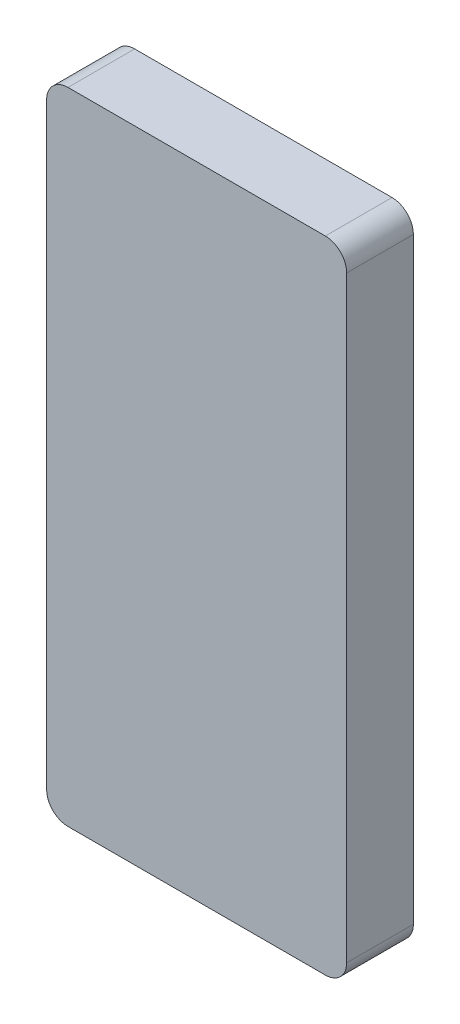
ISO-10303-21;
HEADER;
FILE_DESCRIPTION(('STEP AP214'),'2;1');
FILE_NAME('part.step','',(''),(''),'','','');
FILE_SCHEMA(('AUTOMOTIVE_DESIGN { 1 0 10303 214 1 1 1 1 }'));
ENDSEC;
DATA;
#1=APPLICATION_CONTEXT('core data for automotive mechanical design processes');
#2=APPLICATION_PROTOCOL_DEFINITION('international standard','automotive_design',2000,#1);
#3=PRODUCT_CONTEXT('',#1,'mechanical');
#4=PRODUCT('Part','Part','',(#3));
#5=PRODUCT_RELATED_PRODUCT_CATEGORY('part','',(#4));
#6=PRODUCT_DEFINITION_FORMATION('','',#4);
#7=PRODUCT_DEFINITION_CONTEXT('part definition',#1,'design');
#8=PRODUCT_DEFINITION('design','',#6,#7);
#9=PRODUCT_DEFINITION_SHAPE('','',#8);
#10=(LENGTH_UNIT() NAMED_UNIT(*) SI_UNIT(.MILLI.,.METRE.));
#11=(NAMED_UNIT(*) PLANE_ANGLE_UNIT() SI_UNIT($,.RADIAN.));
#12=(NAMED_UNIT(*) SI_UNIT($,.STERADIAN.) SOLID_ANGLE_UNIT());
#13=UNCERTAINTY_MEASURE_WITH_UNIT(LENGTH_MEASURE(1.E-05),#10,'distance_accuracy_value','');
#14=(GEOMETRIC_REPRESENTATION_CONTEXT(3) GLOBAL_UNCERTAINTY_ASSIGNED_CONTEXT((#13)) GLOBAL_UNIT_ASSIGNED_CONTEXT((#10,
#11,#12)) REPRESENTATION_CONTEXT('',''));
#15=CARTESIAN_POINT('',(0.,0.,0.));
#16=DIRECTION('',(0.,0.,1.));
#17=DIRECTION('',(1.,0.,0.));
#18=AXIS2_PLACEMENT_3D('',#15,#16,#17);
#19=CARTESIAN_POINT('',(-30.63875,71.12,15.875));
#20=DIRECTION('',(0.,0.,-1.));
#21=DIRECTION('',(-1.,0.,0.));
#22=AXIS2_PLACEMENT_3D('',#19,#20,#21);
#23=CYLINDRICAL_SURFACE('',#22,5.08);
#24=CARTESIAN_POINT('',(-30.63875,71.12,0.));
#25=DIRECTION('',(0.,0.,1.));
#26=DIRECTION('',(1.,0.,0.));
#27=AXIS2_PLACEMENT_3D('',#24,#25,#26);
#28=CIRCLE('',#27,5.08);
#29=CARTESIAN_POINT('',(-30.63875,76.2,0.));
#30=VERTEX_POINT('',#29);
#31=CARTESIAN_POINT('',(-35.71875,71.12,0.));
#32=VERTEX_POINT('',#31);
#33=EDGE_CURVE('E148',#30,#32,#28,.T.);
#34=ORIENTED_EDGE('',*,*,#33,.T.);
#35=DIRECTION('',(0.,0.,-1.));
#36=VECTOR('',#35,1.);
#37=CARTESIAN_POINT('',(-35.71875,71.12,15.875));
#38=LINE('',#37,#36);
#39=CARTESIAN_POINT('',(-35.71875,71.12,15.875));
#40=VERTEX_POINT('',#39);
#41=EDGE_CURVE('E13',#40,#32,#38,.T.);
#42=ORIENTED_EDGE('',*,*,#41,.F.);
#43=CARTESIAN_POINT('',(-30.63875,71.12,15.875));
#44=DIRECTION('',(0.,0.,1.));
#45=DIRECTION('',(1.,0.,0.));
#46=AXIS2_PLACEMENT_3D('',#43,#44,#45);
#47=CIRCLE('',#46,5.08);
#48=CARTESIAN_POINT('',(-30.63875,76.2,15.875));
#49=VERTEX_POINT('',#48);
#50=EDGE_CURVE('E170',#49,#40,#47,.T.);
#51=ORIENTED_EDGE('',*,*,#50,.F.);
#52=DIRECTION('',(0.,0.,-1.));
#53=VECTOR('',#52,1.);
#54=CARTESIAN_POINT('',(-30.63875,76.2,15.875));
#55=LINE('',#54,#53);
#56=EDGE_CURVE('E144',#49,#30,#55,.T.);
#57=ORIENTED_EDGE('',*,*,#56,.T.);
#58=EDGE_LOOP('',(#34,#42,#51,#57));
#59=FACE_BOUND('',#58,.T.);
#60=ADVANCED_FACE('F46',(#59),#23,.T.);
#61=CARTESIAN_POINT('',(-35.71875,71.12,15.875));
#62=DIRECTION('',(1.,0.,0.));
#63=DIRECTION('',(0.,1.,0.));
#64=AXIS2_PLACEMENT_3D('',#61,#62,#63);
#65=PLANE('',#64);
#66=DIRECTION('',(0.,-1.,0.));
#67=VECTOR('',#66,1.);
#68=CARTESIAN_POINT('',(-35.71875,71.12,0.));
#69=LINE('',#68,#67);
#70=CARTESIAN_POINT('',(-35.71875,-71.12,0.));
#71=VERTEX_POINT('',#70);
#72=EDGE_CURVE('E152',#32,#71,#69,.T.);
#73=ORIENTED_EDGE('',*,*,#72,.T.);
#74=DIRECTION('',(0.,0.,-1.));
#75=VECTOR('',#74,1.);
#76=CARTESIAN_POINT('',(-35.71875,-71.12,15.875));
#77=LINE('',#76,#75);
#78=CARTESIAN_POINT('',(-35.71875,-71.12,15.875));
#79=VERTEX_POINT('',#78);
#80=EDGE_CURVE('E55',#79,#71,#77,.T.);
#81=ORIENTED_EDGE('',*,*,#80,.F.);
#82=DIRECTION('',(0.,-1.,0.));
#83=VECTOR('',#82,1.);
#84=CARTESIAN_POINT('',(-35.71875,71.12,15.875));
#85=LINE('',#84,#83);
#86=EDGE_CURVE('E106',#40,#79,#85,.T.);
#87=ORIENTED_EDGE('',*,*,#86,.F.);
#88=ORIENTED_EDGE('',*,*,#41,.T.);
#89=EDGE_LOOP('',(#73,#81,#87,#88));
#90=FACE_BOUND('',#89,.T.);
#91=ADVANCED_FACE('F219',(#90),#65,.F.);
#92=CARTESIAN_POINT('',(-30.63875,-71.12,15.875));
#93=DIRECTION('',(0.,0.,-1.));
#94=DIRECTION('',(-1.,0.,0.));
#95=AXIS2_PLACEMENT_3D('',#92,#93,#94);
#96=CYLINDRICAL_SURFACE('',#95,5.08);
#97=CARTESIAN_POINT('',(-30.63875,-71.12,0.));
#98=DIRECTION('',(0.,0.,1.));
#99=DIRECTION('',(1.,0.,0.));
#100=AXIS2_PLACEMENT_3D('',#97,#98,#99);
#101=CIRCLE('',#100,5.08);
#102=CARTESIAN_POINT('',(-30.63875,-76.2,0.));
#103=VERTEX_POINT('',#102);
#104=EDGE_CURVE('E155',#71,#103,#101,.T.);
#105=ORIENTED_EDGE('',*,*,#104,.T.);
#106=DIRECTION('',(0.,0.,-1.));
#107=VECTOR('',#106,1.);
#108=CARTESIAN_POINT('',(-30.63875,-76.2,15.875));
#109=LINE('',#108,#107);
#110=CARTESIAN_POINT('',(-30.63875,-76.2,15.875));
#111=VERTEX_POINT('',#110);
#112=EDGE_CURVE('E181',#111,#103,#109,.T.);
#113=ORIENTED_EDGE('',*,*,#112,.F.);
#114=CARTESIAN_POINT('',(-30.63875,-71.12,15.875));
#115=DIRECTION('',(0.,0.,1.));
#116=DIRECTION('',(1.,0.,0.));
#117=AXIS2_PLACEMENT_3D('',#114,#115,#116);
#118=CIRCLE('',#117,5.08);
#119=EDGE_CURVE('E192',#79,#111,#118,.T.);
#120=ORIENTED_EDGE('',*,*,#119,.F.);
#121=ORIENTED_EDGE('',*,*,#80,.T.);
#122=EDGE_LOOP('',(#105,#113,#120,#121));
#123=FACE_BOUND('',#122,.T.);
#124=ADVANCED_FACE('F190',(#123),#96,.T.);
#125=CARTESIAN_POINT('',(-30.63875,-76.2,15.875));
#126=DIRECTION('',(0.,1.,0.));
#127=DIRECTION('',(0.,0.,1.));
#128=AXIS2_PLACEMENT_3D('',#125,#126,#127);
#129=PLANE('',#128);
#130=DIRECTION('',(1.,0.,0.));
#131=VECTOR('',#130,1.);
#132=CARTESIAN_POINT('',(-30.63875,-76.2,0.));
#133=LINE('',#132,#131);
#134=CARTESIAN_POINT('',(30.63875,-76.2,0.));
#135=VERTEX_POINT('',#134);
#136=EDGE_CURVE('E158',#103,#135,#133,.T.);
#137=ORIENTED_EDGE('',*,*,#136,.T.);
#138=DIRECTION('',(0.,0.,-1.));
#139=VECTOR('',#138,1.);
#140=CARTESIAN_POINT('',(30.63875,-76.2,15.875));
#141=LINE('',#140,#139);
#142=CARTESIAN_POINT('',(30.63875,-76.2,15.875));
#143=VERTEX_POINT('',#142);
#144=EDGE_CURVE('E177',#143,#135,#141,.T.);
#145=ORIENTED_EDGE('',*,*,#144,.F.);
#146=DIRECTION('',(1.,0.,0.));
#147=VECTOR('',#146,1.);
#148=CARTESIAN_POINT('',(-30.63875,-76.2,15.875));
#149=LINE('',#148,#147);
#150=EDGE_CURVE('E205',#111,#143,#149,.T.);
#151=ORIENTED_EDGE('',*,*,#150,.F.);
#152=ORIENTED_EDGE('',*,*,#112,.T.);
#153=EDGE_LOOP('',(#137,#145,#151,#152));
#154=FACE_BOUND('',#153,.T.);
#155=ADVANCED_FACE('F200',(#154),#129,.F.);
#156=CARTESIAN_POINT('',(30.63875,-71.12,15.875));
#157=DIRECTION('',(0.,0.,-1.));
#158=DIRECTION('',(-1.,0.,0.));
#159=AXIS2_PLACEMENT_3D('',#156,#157,#158);
#160=CYLINDRICAL_SURFACE('',#159,5.08);
#161=CARTESIAN_POINT('',(30.63875,-71.12,0.));
#162=DIRECTION('',(0.,0.,1.));
#163=DIRECTION('',(1.,0.,0.));
#164=AXIS2_PLACEMENT_3D('',#161,#162,#163);
#165=CIRCLE('',#164,5.08);
#166=CARTESIAN_POINT('',(35.71875,-71.12,0.));
#167=VERTEX_POINT('',#166);
#168=EDGE_CURVE('E161',#135,#167,#165,.T.);
#169=ORIENTED_EDGE('',*,*,#168,.T.);
#170=DIRECTION('',(0.,0.,-1.));
#171=VECTOR('',#170,1.);
#172=CARTESIAN_POINT('',(35.71875,-71.12,15.875));
#173=LINE('',#172,#171);
#174=CARTESIAN_POINT('',(35.71875,-71.12,15.875));
#175=VERTEX_POINT('',#174);
#176=EDGE_CURVE('E136',#175,#167,#173,.T.);
#177=ORIENTED_EDGE('',*,*,#176,.F.);
#178=CARTESIAN_POINT('',(30.63875,-71.12,15.875));
#179=DIRECTION('',(0.,0.,1.));
#180=DIRECTION('',(1.,0.,0.));
#181=AXIS2_PLACEMENT_3D('',#178,#179,#180);
#182=CIRCLE('',#181,5.08);
#183=EDGE_CURVE('E125',#143,#175,#182,.T.);
#184=ORIENTED_EDGE('',*,*,#183,.F.);
#185=ORIENTED_EDGE('',*,*,#144,.T.);
#186=EDGE_LOOP('',(#169,#177,#184,#185));
#187=FACE_BOUND('',#186,.T.);
#188=ADVANCED_FACE('F203',(#187),#160,.T.);
#189=CARTESIAN_POINT('',(35.71875,71.12,15.875));
#190=DIRECTION('',(-1.,0.,0.));
#191=DIRECTION('',(0.,-1.,0.));
#192=AXIS2_PLACEMENT_3D('',#189,#190,#191);
#193=PLANE('',#192);
#194=DIRECTION('',(0.,1.,0.));
#195=VECTOR('',#194,1.);
#196=CARTESIAN_POINT('',(35.71875,71.12,0.));
#197=LINE('',#196,#195);
#198=CARTESIAN_POINT('',(35.71875,71.12,0.));
#199=VERTEX_POINT('',#198);
#200=EDGE_CURVE('E134',#167,#199,#197,.T.);
#201=ORIENTED_EDGE('',*,*,#200,.T.);
#202=DIRECTION('',(0.,0.,-1.));
#203=VECTOR('',#202,1.);
#204=CARTESIAN_POINT('',(35.71875,71.12,15.875));
#205=LINE('',#204,#203);
#206=CARTESIAN_POINT('',(35.71875,71.12,15.875));
#207=VERTEX_POINT('',#206);
#208=EDGE_CURVE('E131',#207,#199,#205,.T.);
#209=ORIENTED_EDGE('',*,*,#208,.F.);
#210=DIRECTION('',(0.,1.,0.));
#211=VECTOR('',#210,1.);
#212=CARTESIAN_POINT('',(35.71875,71.12,15.875));
#213=LINE('',#212,#211);
#214=EDGE_CURVE('E119',#175,#207,#213,.T.);
#215=ORIENTED_EDGE('',*,*,#214,.F.);
#216=ORIENTED_EDGE('',*,*,#176,.T.);
#217=EDGE_LOOP('',(#201,#209,#215,#216));
#218=FACE_BOUND('',#217,.T.);
#219=ADVANCED_FACE('F132',(#218),#193,.F.);
#220=CARTESIAN_POINT('',(30.63875,71.12,15.875));
#221=DIRECTION('',(0.,0.,-1.));
#222=DIRECTION('',(-1.,0.,0.));
#223=AXIS2_PLACEMENT_3D('',#220,#221,#222);
#224=CYLINDRICAL_SURFACE('',#223,5.08);
#225=CARTESIAN_POINT('',(30.63875,71.12,0.));
#226=DIRECTION('',(0.,0.,1.));
#227=DIRECTION('',(-1.,0.,0.));
#228=AXIS2_PLACEMENT_3D('',#225,#226,#227);
#229=CIRCLE('',#228,5.08);
#230=CARTESIAN_POINT('',(30.63875,76.2,0.));
#231=VERTEX_POINT('',#230);
#232=EDGE_CURVE('E92',#199,#231,#229,.T.);
#233=ORIENTED_EDGE('',*,*,#232,.T.);
#234=DIRECTION('',(0.,0.,-1.));
#235=VECTOR('',#234,1.);
#236=CARTESIAN_POINT('',(30.63875,76.2,15.875));
#237=LINE('',#236,#235);
#238=CARTESIAN_POINT('',(30.63875,76.2,15.875));
#239=VERTEX_POINT('',#238);
#240=EDGE_CURVE('E137',#239,#231,#237,.T.);
#241=ORIENTED_EDGE('',*,*,#240,.F.);
#242=CARTESIAN_POINT('',(30.63875,71.12,15.875));
#243=DIRECTION('',(0.,0.,1.));
#244=DIRECTION('',(-1.,0.,0.));
#245=AXIS2_PLACEMENT_3D('',#242,#243,#244);
#246=CIRCLE('',#245,5.08);
#247=EDGE_CURVE('E123',#207,#239,#246,.T.);
#248=ORIENTED_EDGE('',*,*,#247,.F.);
#249=ORIENTED_EDGE('',*,*,#208,.T.);
#250=EDGE_LOOP('',(#233,#241,#248,#249));
#251=FACE_BOUND('',#250,.T.);
#252=ADVANCED_FACE('F139',(#251),#224,.T.);
#253=CARTESIAN_POINT('',(-30.63875,76.2,15.875));
#254=DIRECTION('',(0.,-1.,0.));
#255=DIRECTION('',(0.,0.,-1.));
#256=AXIS2_PLACEMENT_3D('',#253,#254,#255);
#257=PLANE('',#256);
#258=DIRECTION('',(-1.,0.,0.));
#259=VECTOR('',#258,1.);
#260=CARTESIAN_POINT('',(-30.63875,76.2,0.));
#261=LINE('',#260,#259);
#262=EDGE_CURVE('E98',#231,#30,#261,.T.);
#263=ORIENTED_EDGE('',*,*,#262,.T.);
#264=ORIENTED_EDGE('',*,*,#56,.F.);
#265=DIRECTION('',(-1.,0.,0.));
#266=VECTOR('',#265,1.);
#267=CARTESIAN_POINT('',(-30.63875,76.2,15.875));
#268=LINE('',#267,#266);
#269=EDGE_CURVE('E63',#239,#49,#268,.T.);
#270=ORIENTED_EDGE('',*,*,#269,.F.);
#271=ORIENTED_EDGE('',*,*,#240,.T.);
#272=EDGE_LOOP('',(#263,#264,#270,#271));
#273=FACE_BOUND('',#272,.T.);
#274=ADVANCED_FACE('F235',(#273),#257,.F.);
#275=CARTESIAN_POINT('',(-30.63875,71.12,15.875));
#276=DIRECTION('',(0.,0.,1.));
#277=DIRECTION('',(1.,0.,0.));
#278=AXIS2_PLACEMENT_3D('',#275,#276,#277);
#279=PLANE('',#278);
#280=ORIENTED_EDGE('',*,*,#50,.T.);
#281=ORIENTED_EDGE('',*,*,#86,.T.);
#282=ORIENTED_EDGE('',*,*,#119,.T.);
#283=ORIENTED_EDGE('',*,*,#150,.T.);
#284=ORIENTED_EDGE('',*,*,#183,.T.);
#285=ORIENTED_EDGE('',*,*,#214,.T.);
#286=ORIENTED_EDGE('',*,*,#247,.T.);
#287=ORIENTED_EDGE('',*,*,#269,.T.);
#288=EDGE_LOOP('',(#280,#281,#282,#283,#284,#285,#286,#287));
#289=FACE_BOUND('',#288,.T.);
#290=ADVANCED_FACE('F121',(#289),#279,.T.);
#291=CARTESIAN_POINT('',(-30.63875,71.12,0.));
#292=DIRECTION('',(0.,0.,1.));
#293=DIRECTION('',(1.,0.,0.));
#294=AXIS2_PLACEMENT_3D('',#291,#292,#293);
#295=PLANE('',#294);
#296=ORIENTED_EDGE('',*,*,#33,.F.);
#297=ORIENTED_EDGE('',*,*,#262,.F.);
#298=ORIENTED_EDGE('',*,*,#232,.F.);
#299=ORIENTED_EDGE('',*,*,#200,.F.);
#300=ORIENTED_EDGE('',*,*,#168,.F.);
#301=ORIENTED_EDGE('',*,*,#136,.F.);
#302=ORIENTED_EDGE('',*,*,#104,.F.);
#303=ORIENTED_EDGE('',*,*,#72,.F.);
#304=EDGE_LOOP('',(#296,#297,#298,#299,#300,#301,#302,#303));
#305=FACE_BOUND('',#304,.T.);
#306=ADVANCED_FACE('F196',(#305),#295,.F.);
#307=CLOSED_SHELL('',(#60,#91,#124,#155,#188,#219,#252,#274,#290,#306));
#308=MANIFOLD_SOLID_BREP('B2',#307);
#309=ADVANCED_BREP_SHAPE_REPRESENTATION('',(#18,#308),#14);
#310=SHAPE_DEFINITION_REPRESENTATION(#9,#309);
ENDSEC;
END-ISO-10303-21;
